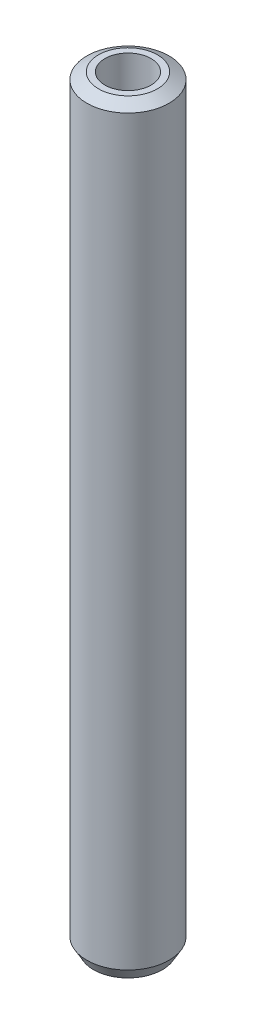
ISO-10303-21;
HEADER;
FILE_DESCRIPTION(('STEP AP214'),'2;1');
FILE_NAME('part.step','',(''),(''),'','','');
FILE_SCHEMA(('AUTOMOTIVE_DESIGN { 1 0 10303 214 1 1 1 1 }'));
ENDSEC;
DATA;
#1=APPLICATION_CONTEXT('core data for automotive mechanical design processes');
#2=APPLICATION_PROTOCOL_DEFINITION('international standard','automotive_design',2000,#1);
#3=PRODUCT_CONTEXT('',#1,'mechanical');
#4=PRODUCT('Part','Part','',(#3));
#5=PRODUCT_RELATED_PRODUCT_CATEGORY('part','',(#4));
#6=PRODUCT_DEFINITION_FORMATION('','',#4);
#7=PRODUCT_DEFINITION_CONTEXT('part definition',#1,'design');
#8=PRODUCT_DEFINITION('design','',#6,#7);
#9=PRODUCT_DEFINITION_SHAPE('','',#8);
#10=(LENGTH_UNIT() NAMED_UNIT(*) SI_UNIT(.MILLI.,.METRE.));
#11=(NAMED_UNIT(*) PLANE_ANGLE_UNIT() SI_UNIT($,.RADIAN.));
#12=(NAMED_UNIT(*) SI_UNIT($,.STERADIAN.) SOLID_ANGLE_UNIT());
#13=UNCERTAINTY_MEASURE_WITH_UNIT(LENGTH_MEASURE(1.E-05),#10,'distance_accuracy_value','');
#14=(GEOMETRIC_REPRESENTATION_CONTEXT(3) GLOBAL_UNCERTAINTY_ASSIGNED_CONTEXT((#13)) GLOBAL_UNIT_ASSIGNED_CONTEXT((#10,
#11,#12)) REPRESENTATION_CONTEXT('',''));
#15=CARTESIAN_POINT('',(0.,0.,0.));
#16=DIRECTION('',(0.,0.,1.));
#17=DIRECTION('',(1.,0.,0.));
#18=AXIS2_PLACEMENT_3D('',#15,#16,#17);
#19=CARTESIAN_POINT('',(0.,370.122258466907,0.));
#20=DIRECTION('',(0.,-1.,0.));
#21=DIRECTION('',(0.,0.,-1.));
#22=AXIS2_PLACEMENT_3D('',#19,#20,#21);
#23=CYLINDRICAL_SURFACE('',#22,20.);
#24=CARTESIAN_POINT('',(0.,366.8632307791,0.));
#25=DIRECTION('',(0.,1.,0.));
#26=DIRECTION('',(0.,0.,1.));
#27=AXIS2_PLACEMENT_3D('',#24,#25,#26);
#28=CIRCLE('',#27,20.);
#29=CARTESIAN_POINT('',(0.,366.8632307791,20.));
#30=VERTEX_POINT('',#29);
#31=EDGE_CURVE('E50',#30,#30,#28,.F.);
#32=ORIENTED_EDGE('',*,*,#31,.T.);
#33=EDGE_LOOP('',(#32));
#34=FACE_BOUND('',#33,.T.);
#35=CARTESIAN_POINT('',(0.,5.6448015385554,0.));
#36=DIRECTION('',(0.,1.,0.));
#37=DIRECTION('',(0.,0.,1.));
#38=AXIS2_PLACEMENT_3D('',#35,#36,#37);
#39=CIRCLE('',#38,20.);
#40=CARTESIAN_POINT('',(0.,5.6448015385554,20.));
#41=VERTEX_POINT('',#40);
#42=EDGE_CURVE('E51',#41,#41,#39,.T.);
#43=ORIENTED_EDGE('',*,*,#42,.T.);
#44=EDGE_LOOP('',(#43));
#45=FACE_BOUND('',#44,.T.);
#46=ADVANCED_FACE('F39',(#34,#45),#23,.T.);
#47=CARTESIAN_POINT('',(0.,370.122258466907,0.));
#48=DIRECTION('',(0.,1.,0.));
#49=DIRECTION('',(0.,0.,1.));
#50=AXIS2_PLACEMENT_3D('',#47,#48,#49);
#51=PLANE('',#50);
#52=CARTESIAN_POINT('',(0.,370.122258466907,0.));
#53=DIRECTION('',(0.,1.,0.));
#54=DIRECTION('',(0.,0.,1.));
#55=AXIS2_PLACEMENT_3D('',#52,#53,#54);
#56=CIRCLE('',#55,14.3551984614448);
#57=CARTESIAN_POINT('',(0.,370.122258466907,14.3551984614448));
#58=VERTEX_POINT('',#57);
#59=EDGE_CURVE('E54',#58,#58,#56,.T.);
#60=ORIENTED_EDGE('',*,*,#59,.T.);
#61=EDGE_LOOP('',(#60));
#62=FACE_BOUND('',#61,.T.);
#63=CARTESIAN_POINT('',(0.,370.122258466907,0.));
#64=DIRECTION('',(0.,1.,0.));
#65=DIRECTION('',(0.,0.,1.));
#66=AXIS2_PLACEMENT_3D('',#63,#64,#65);
#67=CIRCLE('',#66,11.2245669229627);
#68=CARTESIAN_POINT('',(0.,370.122258466907,11.2245669229627));
#69=VERTEX_POINT('',#68);
#70=EDGE_CURVE('E58',#69,#69,#67,.T.);
#71=ORIENTED_EDGE('',*,*,#70,.F.);
#72=EDGE_LOOP('',(#71));
#73=FACE_BOUND('',#72,.T.);
#74=ADVANCED_FACE('F69',(#62,#73),#51,.T.);
#75=CARTESIAN_POINT('',(0.,0.,0.));
#76=DIRECTION('',(0.,1.,0.));
#77=DIRECTION('',(0.,0.,1.));
#78=AXIS2_PLACEMENT_3D('',#75,#76,#77);
#79=PLANE('',#78);
#80=CARTESIAN_POINT('',(0.,0.,0.));
#81=DIRECTION('',(0.,1.,0.));
#82=DIRECTION('',(0.,0.,1.));
#83=AXIS2_PLACEMENT_3D('',#80,#81,#82);
#84=CIRCLE('',#83,16.740972312193);
#85=CARTESIAN_POINT('',(0.,0.,16.740972312193));
#86=VERTEX_POINT('',#85);
#87=EDGE_CURVE('E10',#86,#86,#84,.F.);
#88=ORIENTED_EDGE('',*,*,#87,.T.);
#89=EDGE_LOOP('',(#88));
#90=FACE_BOUND('',#89,.T.);
#91=CARTESIAN_POINT('',(0.,0.,0.));
#92=DIRECTION('',(0.,1.,0.));
#93=DIRECTION('',(0.,0.,1.));
#94=AXIS2_PLACEMENT_3D('',#91,#92,#93);
#95=CIRCLE('',#94,11.2245669229627);
#96=CARTESIAN_POINT('',(0.,0.,11.2245669229627));
#97=VERTEX_POINT('',#96);
#98=EDGE_CURVE('E63',#97,#97,#95,.T.);
#99=ORIENTED_EDGE('',*,*,#98,.T.);
#100=EDGE_LOOP('',(#99));
#101=FACE_BOUND('',#100,.T.);
#102=ADVANCED_FACE('F75',(#90,#101),#79,.F.);
#103=CARTESIAN_POINT('',(0.,370.122258466907,0.));
#104=DIRECTION('',(0.,-1.,0.));
#105=DIRECTION('',(0.,0.,-1.));
#106=AXIS2_PLACEMENT_3D('',#103,#104,#105);
#107=CYLINDRICAL_SURFACE('',#106,11.2245669229627);
#108=ORIENTED_EDGE('',*,*,#70,.T.);
#109=EDGE_LOOP('',(#108));
#110=FACE_BOUND('',#109,.T.);
#111=ORIENTED_EDGE('',*,*,#98,.F.);
#112=EDGE_LOOP('',(#111));
#113=FACE_BOUND('',#112,.T.);
#114=ADVANCED_FACE('F70',(#110,#113),#107,.F.);
#115=CARTESIAN_POINT('',(0.,370.122258466907,0.));
#116=DIRECTION('',(0.,-1.,0.));
#117=DIRECTION('',(0.,0.,-1.));
#118=AXIS2_PLACEMENT_3D('',#115,#116,#117);
#119=CONICAL_SURFACE('',#118,14.3551984614448,1.04719755119659);
#120=ORIENTED_EDGE('',*,*,#31,.F.);
#121=EDGE_LOOP('',(#120));
#122=FACE_BOUND('',#121,.T.);
#123=ORIENTED_EDGE('',*,*,#59,.F.);
#124=EDGE_LOOP('',(#123));
#125=FACE_BOUND('',#124,.T.);
#126=ADVANCED_FACE('F81',(#122,#125),#119,.T.);
#127=CARTESIAN_POINT('',(0.,5.6448015385554,0.));
#128=DIRECTION('',(0.,1.,0.));
#129=DIRECTION('',(0.,0.,1.));
#130=AXIS2_PLACEMENT_3D('',#127,#128,#129);
#131=CONICAL_SURFACE('',#130,20.,0.523598775598301);
#132=ORIENTED_EDGE('',*,*,#87,.F.);
#133=EDGE_LOOP('',(#132));
#134=FACE_BOUND('',#133,.T.);
#135=ORIENTED_EDGE('',*,*,#42,.F.);
#136=EDGE_LOOP('',(#135));
#137=FACE_BOUND('',#136,.T.);
#138=ADVANCED_FACE('F45',(#134,#137),#131,.T.);
#139=CLOSED_SHELL('',(#46,#74,#102,#114,#126,#138));
#140=MANIFOLD_SOLID_BREP('B2',#139);
#141=ADVANCED_BREP_SHAPE_REPRESENTATION('',(#18,#140),#14);
#142=SHAPE_DEFINITION_REPRESENTATION(#9,#141);
ENDSEC;
END-ISO-10303-21;
